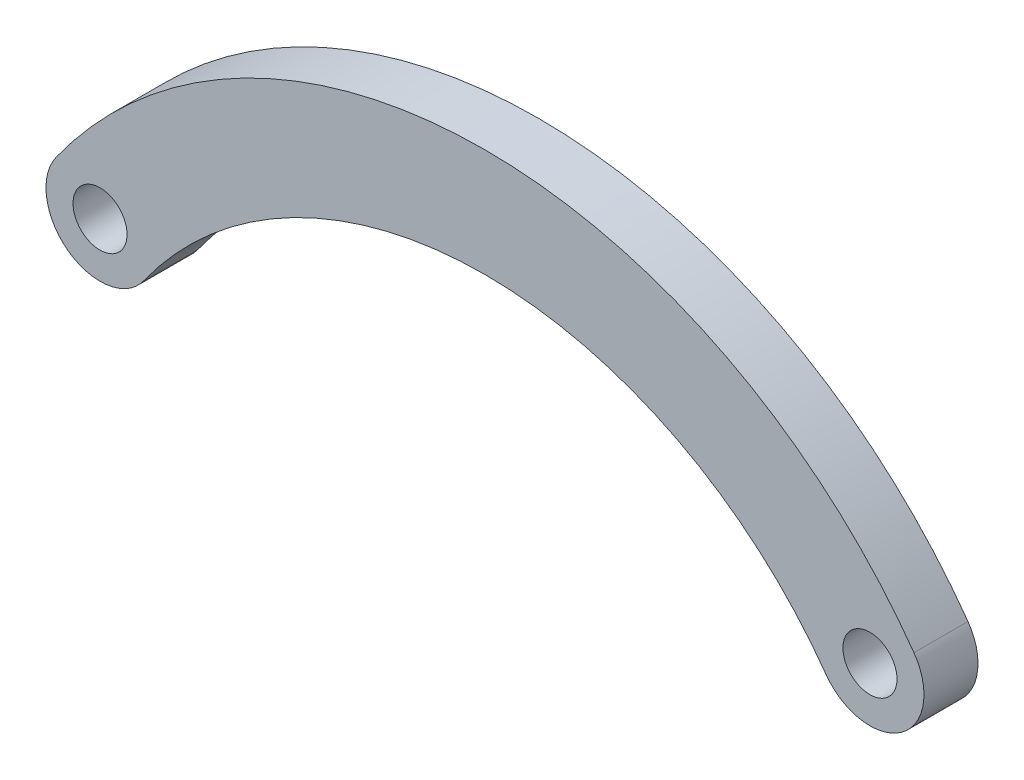
ISO-10303-21;
HEADER;
FILE_DESCRIPTION(('STEP AP214'),'2;1');
FILE_NAME('part.step','',(''),(''),'','','');
FILE_SCHEMA(('AUTOMOTIVE_DESIGN { 1 0 10303 214 1 1 1 1 }'));
ENDSEC;
DATA;
#1=APPLICATION_CONTEXT('core data for automotive mechanical design processes');
#2=APPLICATION_PROTOCOL_DEFINITION('international standard','automotive_design',2000,#1);
#3=PRODUCT_CONTEXT('',#1,'mechanical');
#4=PRODUCT('Part','Part','',(#3));
#5=PRODUCT_RELATED_PRODUCT_CATEGORY('part','',(#4));
#6=PRODUCT_DEFINITION_FORMATION('','',#4);
#7=PRODUCT_DEFINITION_CONTEXT('part definition',#1,'design');
#8=PRODUCT_DEFINITION('design','',#6,#7);
#9=PRODUCT_DEFINITION_SHAPE('','',#8);
#10=(LENGTH_UNIT() NAMED_UNIT(*) SI_UNIT(.MILLI.,.METRE.));
#11=(NAMED_UNIT(*) PLANE_ANGLE_UNIT() SI_UNIT($,.RADIAN.));
#12=(NAMED_UNIT(*) SI_UNIT($,.STERADIAN.) SOLID_ANGLE_UNIT());
#13=UNCERTAINTY_MEASURE_WITH_UNIT(LENGTH_MEASURE(1.E-05),#10,'distance_accuracy_value','');
#14=(GEOMETRIC_REPRESENTATION_CONTEXT(3) GLOBAL_UNCERTAINTY_ASSIGNED_CONTEXT((#13)) GLOBAL_UNIT_ASSIGNED_CONTEXT((#10,
#11,#12)) REPRESENTATION_CONTEXT('',''));
#15=CARTESIAN_POINT('',(0.,0.,0.));
#16=DIRECTION('',(0.,0.,1.));
#17=DIRECTION('',(1.,0.,0.));
#18=AXIS2_PLACEMENT_3D('',#15,#16,#17);
#19=CARTESIAN_POINT('',(-14.25,-10.158124826955,-2.));
#20=DIRECTION('',(0.,0.,1.));
#21=DIRECTION('',(-1.,0.,0.));
#22=AXIS2_PLACEMENT_3D('',#19,#20,#21);
#23=PLANE('',#22);
#24=CARTESIAN_POINT('',(-28.5,0.,-2.));
#25=DIRECTION('',(0.,0.,1.));
#26=DIRECTION('',(-1.,0.,0.));
#27=AXIS2_PLACEMENT_3D('',#24,#25,#26);
#28=CIRCLE('',#27,4.);
#29=CARTESIAN_POINT('',(-31.7571428571429,2.32185710330401,-2.));
#30=VERTEX_POINT('',#29);
#31=CARTESIAN_POINT('',(-25.2428571428571,-2.32185710330401,-2.));
#32=VERTEX_POINT('',#31);
#33=EDGE_CURVE('E93',#30,#32,#28,.T.);
#34=ORIENTED_EDGE('',*,*,#33,.F.);
#35=CARTESIAN_POINT('',(0.,-20.31624965391,-2.));
#36=DIRECTION('',(0.,0.,1.));
#37=DIRECTION('',(-1.,0.,0.));
#38=AXIS2_PLACEMENT_3D('',#35,#36,#37);
#39=CIRCLE('',#38,39.);
#40=CARTESIAN_POINT('',(31.7571428571429,2.32185710330401,-2.));
#41=VERTEX_POINT('',#40);
#42=EDGE_CURVE('E96',#41,#30,#39,.T.);
#43=ORIENTED_EDGE('',*,*,#42,.F.);
#44=CARTESIAN_POINT('',(28.5,0.,-2.));
#45=DIRECTION('',(0.,0.,1.));
#46=DIRECTION('',(1.,0.,0.));
#47=AXIS2_PLACEMENT_3D('',#44,#45,#46);
#48=CIRCLE('',#47,4.);
#49=CARTESIAN_POINT('',(25.2428571428571,-2.321857103304,-2.));
#50=VERTEX_POINT('',#49);
#51=EDGE_CURVE('E84',#50,#41,#48,.T.);
#52=ORIENTED_EDGE('',*,*,#51,.F.);
#53=CARTESIAN_POINT('',(0.,-20.31624965391,-2.));
#54=DIRECTION('',(0.,0.,-1.));
#55=DIRECTION('',(-1.,0.,0.));
#56=AXIS2_PLACEMENT_3D('',#53,#54,#55);
#57=CIRCLE('',#56,31.);
#58=EDGE_CURVE('E89',#32,#50,#57,.T.);
#59=ORIENTED_EDGE('',*,*,#58,.F.);
#60=EDGE_LOOP('',(#34,#43,#52,#59));
#61=FACE_BOUND('',#60,.T.);
#62=CARTESIAN_POINT('',(28.5,0.,-2.));
#63=DIRECTION('',(0.,0.,1.));
#64=DIRECTION('',(1.,0.,0.));
#65=AXIS2_PLACEMENT_3D('',#62,#63,#64);
#66=CIRCLE('',#65,2.);
#67=CARTESIAN_POINT('',(30.5,0.,-2.));
#68=VERTEX_POINT('',#67);
#69=EDGE_CURVE('E105',#68,#68,#66,.T.);
#70=ORIENTED_EDGE('',*,*,#69,.T.);
#71=EDGE_LOOP('',(#70));
#72=FACE_BOUND('',#71,.T.);
#73=CARTESIAN_POINT('',(-28.5,0.,-2.));
#74=DIRECTION('',(0.,0.,1.));
#75=DIRECTION('',(1.,0.,0.));
#76=AXIS2_PLACEMENT_3D('',#73,#74,#75);
#77=CIRCLE('',#76,2.);
#78=CARTESIAN_POINT('',(-26.5,0.,-2.));
#79=VERTEX_POINT('',#78);
#80=EDGE_CURVE('E116',#79,#79,#77,.T.);
#81=ORIENTED_EDGE('',*,*,#80,.T.);
#82=EDGE_LOOP('',(#81));
#83=FACE_BOUND('',#82,.T.);
#84=ADVANCED_FACE('F37',(#61,#72,#83),#23,.F.);
#85=CARTESIAN_POINT('',(-14.25,-10.158124826955,2.));
#86=DIRECTION('',(0.,0.,1.));
#87=DIRECTION('',(-1.,0.,0.));
#88=AXIS2_PLACEMENT_3D('',#85,#86,#87);
#89=PLANE('',#88);
#90=CARTESIAN_POINT('',(28.5,0.,2.));
#91=DIRECTION('',(0.,0.,1.));
#92=DIRECTION('',(1.,0.,0.));
#93=AXIS2_PLACEMENT_3D('',#90,#91,#92);
#94=CIRCLE('',#93,2.);
#95=CARTESIAN_POINT('',(30.5,0.,2.));
#96=VERTEX_POINT('',#95);
#97=EDGE_CURVE('E113',#96,#96,#94,.T.);
#98=ORIENTED_EDGE('',*,*,#97,.F.);
#99=EDGE_LOOP('',(#98));
#100=FACE_BOUND('',#99,.T.);
#101=CARTESIAN_POINT('',(-28.5,0.,2.));
#102=DIRECTION('',(0.,0.,1.));
#103=DIRECTION('',(-1.,0.,0.));
#104=AXIS2_PLACEMENT_3D('',#101,#102,#103);
#105=CIRCLE('',#104,4.);
#106=CARTESIAN_POINT('',(-31.7571428571429,2.32185710330401,2.));
#107=VERTEX_POINT('',#106);
#108=CARTESIAN_POINT('',(-25.2428571428571,-2.32185710330401,2.));
#109=VERTEX_POINT('',#108);
#110=EDGE_CURVE('E101',#107,#109,#105,.T.);
#111=ORIENTED_EDGE('',*,*,#110,.T.);
#112=CARTESIAN_POINT('',(0.,-20.31624965391,2.));
#113=DIRECTION('',(0.,0.,-1.));
#114=DIRECTION('',(-1.,0.,0.));
#115=AXIS2_PLACEMENT_3D('',#112,#113,#114);
#116=CIRCLE('',#115,31.);
#117=CARTESIAN_POINT('',(25.2428571428571,-2.321857103304,2.));
#118=VERTEX_POINT('',#117);
#119=EDGE_CURVE('E104',#109,#118,#116,.T.);
#120=ORIENTED_EDGE('',*,*,#119,.T.);
#121=CARTESIAN_POINT('',(28.5,0.,2.));
#122=DIRECTION('',(0.,0.,1.));
#123=DIRECTION('',(1.,0.,0.));
#124=AXIS2_PLACEMENT_3D('',#121,#122,#123);
#125=CIRCLE('',#124,4.);
#126=CARTESIAN_POINT('',(31.7571428571429,2.32185710330401,2.));
#127=VERTEX_POINT('',#126);
#128=EDGE_CURVE('E87',#118,#127,#125,.T.);
#129=ORIENTED_EDGE('',*,*,#128,.T.);
#130=CARTESIAN_POINT('',(0.,-20.31624965391,2.));
#131=DIRECTION('',(0.,0.,1.));
#132=DIRECTION('',(-1.,0.,0.));
#133=AXIS2_PLACEMENT_3D('',#130,#131,#132);
#134=CIRCLE('',#133,39.);
#135=EDGE_CURVE('E108',#127,#107,#134,.T.);
#136=ORIENTED_EDGE('',*,*,#135,.T.);
#137=EDGE_LOOP('',(#111,#120,#129,#136));
#138=FACE_BOUND('',#137,.T.);
#139=CARTESIAN_POINT('',(-28.5,0.,2.));
#140=DIRECTION('',(0.,0.,1.));
#141=DIRECTION('',(1.,0.,0.));
#142=AXIS2_PLACEMENT_3D('',#139,#140,#141);
#143=CIRCLE('',#142,2.);
#144=CARTESIAN_POINT('',(-26.5,0.,2.));
#145=VERTEX_POINT('',#144);
#146=EDGE_CURVE('E119',#145,#145,#143,.T.);
#147=ORIENTED_EDGE('',*,*,#146,.F.);
#148=EDGE_LOOP('',(#147));
#149=FACE_BOUND('',#148,.T.);
#150=ADVANCED_FACE('F133',(#100,#138,#149),#89,.T.);
#151=CARTESIAN_POINT('',(-28.5,0.,-2.));
#152=DIRECTION('',(0.,0.,1.));
#153=DIRECTION('',(-1.,0.,0.));
#154=AXIS2_PLACEMENT_3D('',#151,#152,#153);
#155=CYLINDRICAL_SURFACE('',#154,4.);
#156=ORIENTED_EDGE('',*,*,#110,.F.);
#157=DIRECTION('',(0.,0.,1.));
#158=VECTOR('',#157,1.);
#159=CARTESIAN_POINT('',(-31.7571428571429,2.32185710330401,-2.));
#160=LINE('',#159,#158);
#161=EDGE_CURVE('E54',#30,#107,#160,.T.);
#162=ORIENTED_EDGE('',*,*,#161,.F.);
#163=ORIENTED_EDGE('',*,*,#33,.T.);
#164=DIRECTION('',(0.,0.,1.));
#165=VECTOR('',#164,1.);
#166=CARTESIAN_POINT('',(-25.2428571428571,-2.32185710330401,-2.));
#167=LINE('',#166,#165);
#168=EDGE_CURVE('E11',#32,#109,#167,.T.);
#169=ORIENTED_EDGE('',*,*,#168,.T.);
#170=EDGE_LOOP('',(#156,#162,#163,#169));
#171=FACE_BOUND('',#170,.T.);
#172=ADVANCED_FACE('F39',(#171),#155,.T.);
#173=CARTESIAN_POINT('',(0.,-20.31624965391,-2.));
#174=DIRECTION('',(0.,0.,1.));
#175=DIRECTION('',(-1.,0.,0.));
#176=AXIS2_PLACEMENT_3D('',#173,#174,#175);
#177=CYLINDRICAL_SURFACE('',#176,31.);
#178=ORIENTED_EDGE('',*,*,#119,.F.);
#179=ORIENTED_EDGE('',*,*,#168,.F.);
#180=ORIENTED_EDGE('',*,*,#58,.T.);
#181=DIRECTION('',(0.,0.,1.));
#182=VECTOR('',#181,1.);
#183=CARTESIAN_POINT('',(25.2428571428571,-2.321857103304,-2.));
#184=LINE('',#183,#182);
#185=EDGE_CURVE('E46',#50,#118,#184,.T.);
#186=ORIENTED_EDGE('',*,*,#185,.T.);
#187=EDGE_LOOP('',(#178,#179,#180,#186));
#188=FACE_BOUND('',#187,.T.);
#189=ADVANCED_FACE('F90',(#188),#177,.F.);
#190=CARTESIAN_POINT('',(28.5,0.,-2.));
#191=DIRECTION('',(0.,0.,1.));
#192=DIRECTION('',(-1.,0.,0.));
#193=AXIS2_PLACEMENT_3D('',#190,#191,#192);
#194=CYLINDRICAL_SURFACE('',#193,4.);
#195=ORIENTED_EDGE('',*,*,#128,.F.);
#196=ORIENTED_EDGE('',*,*,#185,.F.);
#197=ORIENTED_EDGE('',*,*,#51,.T.);
#198=DIRECTION('',(0.,0.,1.));
#199=VECTOR('',#198,1.);
#200=CARTESIAN_POINT('',(31.7571428571429,2.32185710330401,-2.));
#201=LINE('',#200,#199);
#202=EDGE_CURVE('E70',#41,#127,#201,.T.);
#203=ORIENTED_EDGE('',*,*,#202,.T.);
#204=EDGE_LOOP('',(#195,#196,#197,#203));
#205=FACE_BOUND('',#204,.T.);
#206=ADVANCED_FACE('F82',(#205),#194,.T.);
#207=CARTESIAN_POINT('',(0.,-20.31624965391,-2.));
#208=DIRECTION('',(0.,0.,1.));
#209=DIRECTION('',(-1.,0.,0.));
#210=AXIS2_PLACEMENT_3D('',#207,#208,#209);
#211=CYLINDRICAL_SURFACE('',#210,39.);
#212=ORIENTED_EDGE('',*,*,#135,.F.);
#213=ORIENTED_EDGE('',*,*,#202,.F.);
#214=ORIENTED_EDGE('',*,*,#42,.T.);
#215=ORIENTED_EDGE('',*,*,#161,.T.);
#216=EDGE_LOOP('',(#212,#213,#214,#215));
#217=FACE_BOUND('',#216,.T.);
#218=ADVANCED_FACE('F145',(#217),#211,.T.);
#219=CARTESIAN_POINT('',(28.5,0.,-2.));
#220=DIRECTION('',(0.,0.,1.));
#221=DIRECTION('',(-1.,0.,0.));
#222=AXIS2_PLACEMENT_3D('',#219,#220,#221);
#223=CYLINDRICAL_SURFACE('',#222,2.);
#224=ORIENTED_EDGE('',*,*,#69,.F.);
#225=EDGE_LOOP('',(#224));
#226=FACE_BOUND('',#225,.T.);
#227=ORIENTED_EDGE('',*,*,#97,.T.);
#228=EDGE_LOOP('',(#227));
#229=FACE_BOUND('',#228,.T.);
#230=ADVANCED_FACE('F129',(#226,#229),#223,.F.);
#231=CARTESIAN_POINT('',(-28.5,0.,-2.));
#232=DIRECTION('',(0.,0.,1.));
#233=DIRECTION('',(-1.,0.,0.));
#234=AXIS2_PLACEMENT_3D('',#231,#232,#233);
#235=CYLINDRICAL_SURFACE('',#234,2.);
#236=ORIENTED_EDGE('',*,*,#80,.F.);
#237=EDGE_LOOP('',(#236));
#238=FACE_BOUND('',#237,.T.);
#239=ORIENTED_EDGE('',*,*,#146,.T.);
#240=EDGE_LOOP('',(#239));
#241=FACE_BOUND('',#240,.T.);
#242=ADVANCED_FACE('F126',(#238,#241),#235,.F.);
#243=CLOSED_SHELL('',(#84,#150,#172,#189,#206,#218,#230,#242));
#244=MANIFOLD_SOLID_BREP('B2',#243);
#245=ADVANCED_BREP_SHAPE_REPRESENTATION('',(#18,#244),#14);
#246=SHAPE_DEFINITION_REPRESENTATION(#9,#245);
ENDSEC;
END-ISO-10303-21;
